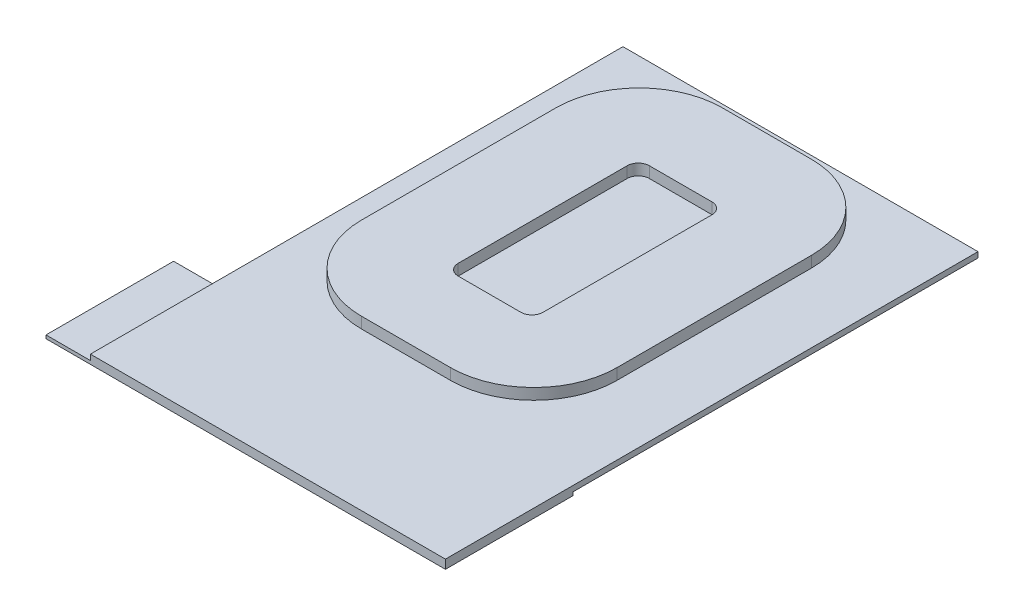
ISO-10303-21;
HEADER;
FILE_DESCRIPTION(('STEP AP214'),'2;1');
FILE_NAME('part.step','',(''),(''),'','','');
FILE_SCHEMA(('AUTOMOTIVE_DESIGN { 1 0 10303 214 1 1 1 1 }'));
ENDSEC;
DATA;
#1=APPLICATION_CONTEXT('core data for automotive mechanical design processes');
#2=APPLICATION_PROTOCOL_DEFINITION('international standard','automotive_design',2000,#1);
#3=PRODUCT_CONTEXT('',#1,'mechanical');
#4=PRODUCT('Part','Part','',(#3));
#5=PRODUCT_RELATED_PRODUCT_CATEGORY('part','',(#4));
#6=PRODUCT_DEFINITION_FORMATION('','',#4);
#7=PRODUCT_DEFINITION_CONTEXT('part definition',#1,'design');
#8=PRODUCT_DEFINITION('design','',#6,#7);
#9=PRODUCT_DEFINITION_SHAPE('','',#8);
#10=(LENGTH_UNIT() NAMED_UNIT(*) SI_UNIT(.MILLI.,.METRE.));
#11=(NAMED_UNIT(*) PLANE_ANGLE_UNIT() SI_UNIT($,.RADIAN.));
#12=(NAMED_UNIT(*) SI_UNIT($,.STERADIAN.) SOLID_ANGLE_UNIT());
#13=UNCERTAINTY_MEASURE_WITH_UNIT(LENGTH_MEASURE(1.E-05),#10,'distance_accuracy_value','');
#14=(GEOMETRIC_REPRESENTATION_CONTEXT(3) GLOBAL_UNCERTAINTY_ASSIGNED_CONTEXT((#13)) GLOBAL_UNIT_ASSIGNED_CONTEXT((#10,
#11,#12)) REPRESENTATION_CONTEXT('',''));
#15=CARTESIAN_POINT('',(0.,0.,0.));
#16=DIRECTION('',(0.,0.,1.));
#17=DIRECTION('',(1.,0.,0.));
#18=AXIS2_PLACEMENT_3D('',#15,#16,#17);
#19=CARTESIAN_POINT('',(0.,0.5,0.));
#20=DIRECTION('',(0.,-1.,0.));
#21=DIRECTION('',(0.,0.,-1.));
#22=AXIS2_PLACEMENT_3D('',#19,#20,#21);
#23=PLANE('',#22);
#24=DIRECTION('',(0.,0.,-1.));
#25=VECTOR('',#24,1.);
#26=CARTESIAN_POINT('',(16.,0.5,24.));
#27=LINE('',#26,#25);
#28=CARTESIAN_POINT('',(16.,0.5,24.));
#29=VERTEX_POINT('',#28);
#30=CARTESIAN_POINT('',(16.,0.5,-24.));
#31=VERTEX_POINT('',#30);
#32=EDGE_CURVE('E201',#29,#31,#27,.T.);
#33=ORIENTED_EDGE('',*,*,#32,.T.);
#34=DIRECTION('',(-1.,0.,0.));
#35=VECTOR('',#34,1.);
#36=CARTESIAN_POINT('',(-16.,0.5,-24.));
#37=LINE('',#36,#35);
#38=CARTESIAN_POINT('',(-16.,0.5,-24.));
#39=VERTEX_POINT('',#38);
#40=EDGE_CURVE('E359',#31,#39,#37,.T.);
#41=ORIENTED_EDGE('',*,*,#40,.T.);
#42=DIRECTION('',(0.,0.,1.));
#43=VECTOR('',#42,1.);
#44=CARTESIAN_POINT('',(-16.,0.5,24.));
#45=LINE('',#44,#43);
#46=CARTESIAN_POINT('',(-16.,0.5,24.));
#47=VERTEX_POINT('',#46);
#48=EDGE_CURVE('E362',#39,#47,#45,.T.);
#49=ORIENTED_EDGE('',*,*,#48,.T.);
#50=DIRECTION('',(1.,0.,0.));
#51=VECTOR('',#50,1.);
#52=CARTESIAN_POINT('',(-16.,0.5,24.));
#53=LINE('',#52,#51);
#54=EDGE_CURVE('E205',#47,#29,#53,.T.);
#55=ORIENTED_EDGE('',*,*,#54,.T.);
#56=EDGE_LOOP('',(#33,#41,#49,#55));
#57=FACE_BOUND('',#56,.T.);
#58=CARTESIAN_POINT('',(-5.7444345917951,0.5,2.32262018358056));
#59=DIRECTION('',(0.,1.,0.));
#60=DIRECTION('',(0.,0.,1.));
#61=AXIS2_PLACEMENT_3D('',#58,#59,#60);
#62=CIRCLE('',#61,7.5);
#63=CARTESIAN_POINT('',(-13.2444345917951,0.5,2.32262018358051));
#64=VERTEX_POINT('',#63);
#65=CARTESIAN_POINT('',(-5.74443459179504,0.5,9.82262018358056));
#66=VERTEX_POINT('',#65);
#67=EDGE_CURVE('E295',#64,#66,#62,.T.);
#68=ORIENTED_EDGE('',*,*,#67,.F.);
#69=DIRECTION('',(0.,0.,1.));
#70=VECTOR('',#69,1.);
#71=CARTESIAN_POINT('',(-13.2444345917951,0.5,-15.2047450145058));
#72=LINE('',#71,#70);
#73=CARTESIAN_POINT('',(-13.2444345917951,0.5,-15.2047450145058));
#74=VERTEX_POINT('',#73);
#75=EDGE_CURVE('E300',#74,#64,#72,.T.);
#76=ORIENTED_EDGE('',*,*,#75,.F.);
#77=CARTESIAN_POINT('',(-5.7444345917951,0.5,-15.2047450145059));
#78=DIRECTION('',(0.,1.,0.));
#79=DIRECTION('',(0.,0.,1.));
#80=AXIS2_PLACEMENT_3D('',#77,#78,#79);
#81=CIRCLE('',#80,7.5);
#82=CARTESIAN_POINT('',(-5.7444345917951,0.5,-22.7047450145059));
#83=VERTEX_POINT('',#82);
#84=EDGE_CURVE('E330',#83,#74,#81,.T.);
#85=ORIENTED_EDGE('',*,*,#84,.F.);
#86=DIRECTION('',(-1.,0.,0.));
#87=VECTOR('',#86,1.);
#88=CARTESIAN_POINT('',(-5.74443459179505,0.5,-22.7047450145059));
#89=LINE('',#88,#87);
#90=CARTESIAN_POINT('',(2.28236354348386,0.5,-22.7047450145059));
#91=VERTEX_POINT('',#90);
#92=EDGE_CURVE('E327',#91,#83,#89,.T.);
#93=ORIENTED_EDGE('',*,*,#92,.F.);
#94=CARTESIAN_POINT('',(2.28236354348391,0.5,-15.2047450145059));
#95=DIRECTION('',(0.,1.,0.));
#96=DIRECTION('',(0.,0.,-1.));
#97=AXIS2_PLACEMENT_3D('',#94,#95,#96);
#98=CIRCLE('',#97,7.5);
#99=CARTESIAN_POINT('',(9.78236354348391,0.5,-15.2047450145058));
#100=VERTEX_POINT('',#99);
#101=EDGE_CURVE('E324',#100,#91,#98,.T.);
#102=ORIENTED_EDGE('',*,*,#101,.F.);
#103=DIRECTION('',(0.,0.,-1.));
#104=VECTOR('',#103,1.);
#105=CARTESIAN_POINT('',(9.78236354348391,0.5,-15.2047450145058));
#106=LINE('',#105,#104);
#107=CARTESIAN_POINT('',(9.78236354348391,0.5,2.32262018358051));
#108=VERTEX_POINT('',#107);
#109=EDGE_CURVE('E321',#108,#100,#106,.T.);
#110=ORIENTED_EDGE('',*,*,#109,.F.);
#111=CARTESIAN_POINT('',(2.28236354348391,0.5,2.32262018358056));
#112=DIRECTION('',(0.,1.,0.));
#113=DIRECTION('',(0.,0.,1.));
#114=AXIS2_PLACEMENT_3D('',#111,#112,#113);
#115=CIRCLE('',#114,7.5);
#116=CARTESIAN_POINT('',(2.28236354348386,0.5,9.82262018358056));
#117=VERTEX_POINT('',#116);
#118=EDGE_CURVE('E318',#117,#108,#115,.T.);
#119=ORIENTED_EDGE('',*,*,#118,.F.);
#120=DIRECTION('',(1.,0.,0.));
#121=VECTOR('',#120,1.);
#122=CARTESIAN_POINT('',(-5.74443459179504,0.5,9.82262018358056));
#123=LINE('',#122,#121);
#124=EDGE_CURVE('E57',#66,#117,#123,.T.);
#125=ORIENTED_EDGE('',*,*,#124,.F.);
#126=EDGE_LOOP('',(#68,#76,#85,#93,#102,#110,#119,#125));
#127=FACE_BOUND('',#126,.T.);
#128=ADVANCED_FACE('F34',(#57,#127),#23,.F.);
#129=CARTESIAN_POINT('',(16.,0.5,24.));
#130=DIRECTION('',(-1.,0.,0.));
#131=DIRECTION('',(0.,0.,1.));
#132=AXIS2_PLACEMENT_3D('',#129,#130,#131);
#133=PLANE('',#132);
#134=DIRECTION('',(0.,-1.,0.));
#135=VECTOR('',#134,1.);
#136=CARTESIAN_POINT('',(16.,0.5,24.));
#137=LINE('',#136,#135);
#138=CARTESIAN_POINT('',(16.,-0.3,24.));
#139=VERTEX_POINT('',#138);
#140=EDGE_CURVE('E194',#29,#139,#137,.T.);
#141=ORIENTED_EDGE('',*,*,#140,.T.);
#142=DIRECTION('',(0.,0.,1.));
#143=VECTOR('',#142,1.);
#144=CARTESIAN_POINT('',(16.,-0.3,24.));
#145=LINE('',#144,#143);
#146=CARTESIAN_POINT('',(16.,-0.3,12.5));
#147=VERTEX_POINT('',#146);
#148=EDGE_CURVE('E198',#147,#139,#145,.T.);
#149=ORIENTED_EDGE('',*,*,#148,.F.);
#150=DIRECTION('',(0.,1.,0.));
#151=VECTOR('',#150,1.);
#152=CARTESIAN_POINT('',(16.,-0.3,12.5));
#153=LINE('',#152,#151);
#154=CARTESIAN_POINT('',(16.,0.,12.5));
#155=VERTEX_POINT('',#154);
#156=EDGE_CURVE('E229',#147,#155,#153,.T.);
#157=ORIENTED_EDGE('',*,*,#156,.T.);
#158=DIRECTION('',(0.,0.,-1.));
#159=VECTOR('',#158,1.);
#160=CARTESIAN_POINT('',(16.,0.,24.));
#161=LINE('',#160,#159);
#162=CARTESIAN_POINT('',(16.,0.,-24.));
#163=VERTEX_POINT('',#162);
#164=EDGE_CURVE('E357',#155,#163,#161,.T.);
#165=ORIENTED_EDGE('',*,*,#164,.T.);
#166=DIRECTION('',(0.,-1.,0.));
#167=VECTOR('',#166,1.);
#168=CARTESIAN_POINT('',(16.,0.5,-24.));
#169=LINE('',#168,#167);
#170=EDGE_CURVE('E43',#31,#163,#169,.T.);
#171=ORIENTED_EDGE('',*,*,#170,.F.);
#172=ORIENTED_EDGE('',*,*,#32,.F.);
#173=EDGE_LOOP('',(#141,#149,#157,#165,#171,#172));
#174=FACE_BOUND('',#173,.T.);
#175=ADVANCED_FACE('F36',(#174),#133,.F.);
#176=CARTESIAN_POINT('',(-16.,0.5,-24.));
#177=DIRECTION('',(0.,0.,1.));
#178=DIRECTION('',(1.,0.,0.));
#179=AXIS2_PLACEMENT_3D('',#176,#177,#178);
#180=PLANE('',#179);
#181=DIRECTION('',(-1.,0.,0.));
#182=VECTOR('',#181,1.);
#183=CARTESIAN_POINT('',(-16.,0.,-24.));
#184=LINE('',#183,#182);
#185=CARTESIAN_POINT('',(-16.,0.,-24.));
#186=VERTEX_POINT('',#185);
#187=EDGE_CURVE('E367',#163,#186,#184,.T.);
#188=ORIENTED_EDGE('',*,*,#187,.T.);
#189=DIRECTION('',(0.,-1.,0.));
#190=VECTOR('',#189,1.);
#191=CARTESIAN_POINT('',(-16.,0.5,-24.));
#192=LINE('',#191,#190);
#193=EDGE_CURVE('E393',#39,#186,#192,.T.);
#194=ORIENTED_EDGE('',*,*,#193,.F.);
#195=ORIENTED_EDGE('',*,*,#40,.F.);
#196=ORIENTED_EDGE('',*,*,#170,.T.);
#197=EDGE_LOOP('',(#188,#194,#195,#196));
#198=FACE_BOUND('',#197,.T.);
#199=ADVANCED_FACE('F401',(#198),#180,.F.);
#200=CARTESIAN_POINT('',(-16.,0.5,24.));
#201=DIRECTION('',(1.,0.,0.));
#202=DIRECTION('',(0.,0.,-1.));
#203=AXIS2_PLACEMENT_3D('',#200,#201,#202);
#204=PLANE('',#203);
#205=DIRECTION('',(0.,0.,1.));
#206=VECTOR('',#205,1.);
#207=CARTESIAN_POINT('',(-16.,0.,24.));
#208=LINE('',#207,#206);
#209=CARTESIAN_POINT('',(-16.,0.,12.5));
#210=VERTEX_POINT('',#209);
#211=EDGE_CURVE('E360',#186,#210,#208,.T.);
#212=ORIENTED_EDGE('',*,*,#211,.T.);
#213=CARTESIAN_POINT('',(-16.,0.,24.));
#214=VERTEX_POINT('',#213);
#215=EDGE_CURVE('E387',#210,#214,#208,.T.);
#216=ORIENTED_EDGE('',*,*,#215,.T.);
#217=DIRECTION('',(0.,-1.,0.));
#218=VECTOR('',#217,1.);
#219=CARTESIAN_POINT('',(-16.,0.5,24.));
#220=LINE('',#219,#218);
#221=EDGE_CURVE('E204',#47,#214,#220,.T.);
#222=ORIENTED_EDGE('',*,*,#221,.F.);
#223=ORIENTED_EDGE('',*,*,#48,.F.);
#224=ORIENTED_EDGE('',*,*,#193,.T.);
#225=EDGE_LOOP('',(#212,#216,#222,#223,#224));
#226=FACE_BOUND('',#225,.T.);
#227=ADVANCED_FACE('F398',(#226),#204,.F.);
#228=CARTESIAN_POINT('',(-16.,0.5,24.));
#229=DIRECTION('',(0.,0.,-1.));
#230=DIRECTION('',(-1.,0.,0.));
#231=AXIS2_PLACEMENT_3D('',#228,#229,#230);
#232=PLANE('',#231);
#233=ORIENTED_EDGE('',*,*,#221,.T.);
#234=DIRECTION('',(-1.,0.,0.));
#235=VECTOR('',#234,1.);
#236=CARTESIAN_POINT('',(16.,0.,24.));
#237=LINE('',#236,#235);
#238=CARTESIAN_POINT('',(-20.,0.,24.));
#239=VERTEX_POINT('',#238);
#240=EDGE_CURVE('E233',#214,#239,#237,.T.);
#241=ORIENTED_EDGE('',*,*,#240,.T.);
#242=DIRECTION('',(0.,1.,0.));
#243=VECTOR('',#242,1.);
#244=CARTESIAN_POINT('',(-20.,-0.3,24.));
#245=LINE('',#244,#243);
#246=CARTESIAN_POINT('',(-20.,-0.3,24.));
#247=VERTEX_POINT('',#246);
#248=EDGE_CURVE('E212',#247,#239,#245,.T.);
#249=ORIENTED_EDGE('',*,*,#248,.F.);
#250=DIRECTION('',(-1.,0.,0.));
#251=VECTOR('',#250,1.);
#252=CARTESIAN_POINT('',(16.,-0.3,24.));
#253=LINE('',#252,#251);
#254=EDGE_CURVE('E208',#139,#247,#253,.T.);
#255=ORIENTED_EDGE('',*,*,#254,.F.);
#256=ORIENTED_EDGE('',*,*,#140,.F.);
#257=ORIENTED_EDGE('',*,*,#54,.F.);
#258=EDGE_LOOP('',(#233,#241,#249,#255,#256,#257));
#259=FACE_BOUND('',#258,.T.);
#260=ADVANCED_FACE('F210',(#259),#232,.F.);
#261=CARTESIAN_POINT('',(0.,0.,0.));
#262=DIRECTION('',(0.,-1.,0.));
#263=DIRECTION('',(0.,0.,-1.));
#264=AXIS2_PLACEMENT_3D('',#261,#262,#263);
#265=PLANE('',#264);
#266=DIRECTION('',(1.,0.,0.));
#267=VECTOR('',#266,1.);
#268=CARTESIAN_POINT('',(16.,0.,12.5));
#269=LINE('',#268,#267);
#270=EDGE_CURVE('E11',#210,#155,#269,.T.);
#271=ORIENTED_EDGE('',*,*,#270,.F.);
#272=ORIENTED_EDGE('',*,*,#211,.F.);
#273=ORIENTED_EDGE('',*,*,#187,.F.);
#274=ORIENTED_EDGE('',*,*,#164,.F.);
#275=EDGE_LOOP('',(#271,#272,#273,#274));
#276=FACE_BOUND('',#275,.T.);
#277=ADVANCED_FACE('F402',(#276),#265,.T.);
#278=CARTESIAN_POINT('',(-5.7444345917951,1.5,2.32262018358056));
#279=DIRECTION('',(0.,1.,0.));
#280=DIRECTION('',(0.,0.,1.));
#281=AXIS2_PLACEMENT_3D('',#278,#279,#280);
#282=PLANE('',#281);
#283=CARTESIAN_POINT('',(-5.7444345917951,1.5,2.32262018358056));
#284=DIRECTION('',(0.,1.,0.));
#285=DIRECTION('',(0.,0.,1.));
#286=AXIS2_PLACEMENT_3D('',#283,#284,#285);
#287=CIRCLE('',#286,7.5);
#288=CARTESIAN_POINT('',(-13.2444345917951,1.5,2.32262018358051));
#289=VERTEX_POINT('',#288);
#290=CARTESIAN_POINT('',(-5.74443459179504,1.5,9.82262018358056));
#291=VERTEX_POINT('',#290);
#292=EDGE_CURVE('E296',#289,#291,#287,.T.);
#293=ORIENTED_EDGE('',*,*,#292,.T.);
#294=DIRECTION('',(1.,0.,0.));
#295=VECTOR('',#294,1.);
#296=CARTESIAN_POINT('',(-5.74443459179504,1.5,9.82262018358056));
#297=LINE('',#296,#295);
#298=CARTESIAN_POINT('',(2.28236354348386,1.5,9.82262018358056));
#299=VERTEX_POINT('',#298);
#300=EDGE_CURVE('E299',#291,#299,#297,.T.);
#301=ORIENTED_EDGE('',*,*,#300,.T.);
#302=CARTESIAN_POINT('',(2.28236354348391,1.5,2.32262018358056));
#303=DIRECTION('',(0.,1.,0.));
#304=DIRECTION('',(0.,0.,1.));
#305=AXIS2_PLACEMENT_3D('',#302,#303,#304);
#306=CIRCLE('',#305,7.5);
#307=CARTESIAN_POINT('',(9.78236354348391,1.5,2.32262018358051));
#308=VERTEX_POINT('',#307);
#309=EDGE_CURVE('E302',#299,#308,#306,.T.);
#310=ORIENTED_EDGE('',*,*,#309,.T.);
#311=DIRECTION('',(0.,0.,-1.));
#312=VECTOR('',#311,1.);
#313=CARTESIAN_POINT('',(9.78236354348391,1.5,-15.2047450145058));
#314=LINE('',#313,#312);
#315=CARTESIAN_POINT('',(9.78236354348391,1.5,-15.2047450145058));
#316=VERTEX_POINT('',#315);
#317=EDGE_CURVE('E304',#308,#316,#314,.T.);
#318=ORIENTED_EDGE('',*,*,#317,.T.);
#319=CARTESIAN_POINT('',(2.28236354348391,1.5,-15.2047450145059));
#320=DIRECTION('',(0.,1.,0.));
#321=DIRECTION('',(0.,0.,-1.));
#322=AXIS2_PLACEMENT_3D('',#319,#320,#321);
#323=CIRCLE('',#322,7.5);
#324=CARTESIAN_POINT('',(2.28236354348386,1.5,-22.7047450145059));
#325=VERTEX_POINT('',#324);
#326=EDGE_CURVE('E306',#316,#325,#323,.T.);
#327=ORIENTED_EDGE('',*,*,#326,.T.);
#328=DIRECTION('',(-1.,0.,0.));
#329=VECTOR('',#328,1.);
#330=CARTESIAN_POINT('',(-5.74443459179505,1.5,-22.7047450145059));
#331=LINE('',#330,#329);
#332=CARTESIAN_POINT('',(-5.74443459179505,1.5,-22.7047450145059));
#333=VERTEX_POINT('',#332);
#334=EDGE_CURVE('E308',#325,#333,#331,.T.);
#335=ORIENTED_EDGE('',*,*,#334,.T.);
#336=CARTESIAN_POINT('',(-5.7444345917951,1.5,-15.2047450145059));
#337=DIRECTION('',(0.,1.,0.));
#338=DIRECTION('',(0.,0.,1.));
#339=AXIS2_PLACEMENT_3D('',#336,#337,#338);
#340=CIRCLE('',#339,7.5);
#341=CARTESIAN_POINT('',(-13.2444345917951,1.5,-15.2047450145058));
#342=VERTEX_POINT('',#341);
#343=EDGE_CURVE('E310',#333,#342,#340,.T.);
#344=ORIENTED_EDGE('',*,*,#343,.T.);
#345=DIRECTION('',(0.,0.,1.));
#346=VECTOR('',#345,1.);
#347=CARTESIAN_POINT('',(-13.2444345917951,1.5,-15.2047450145058));
#348=LINE('',#347,#346);
#349=EDGE_CURVE('E312',#342,#289,#348,.T.);
#350=ORIENTED_EDGE('',*,*,#349,.T.);
#351=EDGE_LOOP('',(#293,#301,#310,#318,#327,#335,#344,#350));
#352=FACE_BOUND('',#351,.T.);
#353=DIRECTION('',(0.,0.,1.));
#354=VECTOR('',#353,1.);
#355=CARTESIAN_POINT('',(-5.5151596932399,1.5,-13.8949568357574));
#356=LINE('',#355,#354);
#357=CARTESIAN_POINT('',(-5.5151596932399,1.5,-13.8949568357574));
#358=VERTEX_POINT('',#357);
#359=CARTESIAN_POINT('',(-5.5151596932399,1.5,1.33488512560521));
#360=VERTEX_POINT('',#359);
#361=EDGE_CURVE('E239',#358,#360,#356,.T.);
#362=ORIENTED_EDGE('',*,*,#361,.F.);
#363=CARTESIAN_POINT('',(-4.5151596932399,1.5,-13.8949568357574));
#364=DIRECTION('',(0.,1.,0.));
#365=DIRECTION('',(0.,0.,1.));
#366=AXIS2_PLACEMENT_3D('',#363,#364,#365);
#367=CIRCLE('',#366,1.);
#368=CARTESIAN_POINT('',(-4.51515969323989,1.5,-14.8949568357574));
#369=VERTEX_POINT('',#368);
#370=EDGE_CURVE('E237',#369,#358,#367,.T.);
#371=ORIENTED_EDGE('',*,*,#370,.F.);
#372=DIRECTION('',(-1.,0.,0.));
#373=VECTOR('',#372,1.);
#374=CARTESIAN_POINT('',(-4.51515969323989,1.5,-14.8949568357574));
#375=LINE('',#374,#373);
#376=CARTESIAN_POINT('',(1.133601925122,1.5,-14.8949568357574));
#377=VERTEX_POINT('',#376);
#378=EDGE_CURVE('E253',#377,#369,#375,.T.);
#379=ORIENTED_EDGE('',*,*,#378,.F.);
#380=CARTESIAN_POINT('',(1.13360192512201,1.5,-13.8949568357574));
#381=DIRECTION('',(0.,1.,0.));
#382=DIRECTION('',(0.,0.,-1.));
#383=AXIS2_PLACEMENT_3D('',#380,#381,#382);
#384=CIRCLE('',#383,1.);
#385=CARTESIAN_POINT('',(2.13360192512201,1.5,-13.8949568357574));
#386=VERTEX_POINT('',#385);
#387=EDGE_CURVE('E250',#386,#377,#384,.T.);
#388=ORIENTED_EDGE('',*,*,#387,.F.);
#389=DIRECTION('',(0.,0.,-1.));
#390=VECTOR('',#389,1.);
#391=CARTESIAN_POINT('',(2.13360192512201,1.5,-13.8949568357574));
#392=LINE('',#391,#390);
#393=CARTESIAN_POINT('',(2.13360192512201,1.5,1.33488512560521));
#394=VERTEX_POINT('',#393);
#395=EDGE_CURVE('E248',#394,#386,#392,.T.);
#396=ORIENTED_EDGE('',*,*,#395,.F.);
#397=CARTESIAN_POINT('',(1.13360192512201,1.5,1.33488512560521));
#398=DIRECTION('',(0.,1.,0.));
#399=DIRECTION('',(0.,0.,1.));
#400=AXIS2_PLACEMENT_3D('',#397,#398,#399);
#401=CIRCLE('',#400,1.);
#402=CARTESIAN_POINT('',(1.133601925122,1.5,2.33488512560521));
#403=VERTEX_POINT('',#402);
#404=EDGE_CURVE('E246',#403,#394,#401,.T.);
#405=ORIENTED_EDGE('',*,*,#404,.F.);
#406=DIRECTION('',(1.,0.,0.));
#407=VECTOR('',#406,1.);
#408=CARTESIAN_POINT('',(-4.51515969323989,1.5,2.33488512560521));
#409=LINE('',#408,#407);
#410=CARTESIAN_POINT('',(-4.51515969323989,1.5,2.33488512560521));
#411=VERTEX_POINT('',#410);
#412=EDGE_CURVE('E244',#411,#403,#409,.T.);
#413=ORIENTED_EDGE('',*,*,#412,.F.);
#414=CARTESIAN_POINT('',(-4.5151596932399,1.5,1.33488512560521));
#415=DIRECTION('',(0.,1.,0.));
#416=DIRECTION('',(0.,0.,1.));
#417=AXIS2_PLACEMENT_3D('',#414,#415,#416);
#418=CIRCLE('',#417,1.);
#419=EDGE_CURVE('E242',#360,#411,#418,.T.);
#420=ORIENTED_EDGE('',*,*,#419,.F.);
#421=EDGE_LOOP('',(#362,#371,#379,#388,#396,#405,#413,#420));
#422=FACE_BOUND('',#421,.T.);
#423=ADVANCED_FACE('F404',(#352,#422),#282,.T.);
#424=CARTESIAN_POINT('',(-5.7444345917951,1.5,2.32262018358056));
#425=DIRECTION('',(0.,-1.,0.));
#426=DIRECTION('',(0.,0.,-1.));
#427=AXIS2_PLACEMENT_3D('',#424,#425,#426);
#428=CYLINDRICAL_SURFACE('',#427,7.5);
#429=ORIENTED_EDGE('',*,*,#67,.T.);
#430=DIRECTION('',(0.,-1.,0.));
#431=VECTOR('',#430,1.);
#432=CARTESIAN_POINT('',(-5.74443459179504,1.5,9.82262018358056));
#433=LINE('',#432,#431);
#434=EDGE_CURVE('E355',#291,#66,#433,.T.);
#435=ORIENTED_EDGE('',*,*,#434,.F.);
#436=ORIENTED_EDGE('',*,*,#292,.F.);
#437=DIRECTION('',(0.,-1.,0.));
#438=VECTOR('',#437,1.);
#439=CARTESIAN_POINT('',(-13.2444345917951,1.5,2.32262018358051));
#440=LINE('',#439,#438);
#441=EDGE_CURVE('E314',#289,#64,#440,.T.);
#442=ORIENTED_EDGE('',*,*,#441,.T.);
#443=EDGE_LOOP('',(#429,#435,#436,#442));
#444=FACE_BOUND('',#443,.T.);
#445=ADVANCED_FACE('F410',(#444),#428,.T.);
#446=CARTESIAN_POINT('',(-5.74443459179504,1.5,9.82262018358056));
#447=DIRECTION('',(0.,0.,-1.));
#448=DIRECTION('',(-1.,0.,0.));
#449=AXIS2_PLACEMENT_3D('',#446,#447,#448);
#450=PLANE('',#449);
#451=ORIENTED_EDGE('',*,*,#124,.T.);
#452=DIRECTION('',(0.,-1.,0.));
#453=VECTOR('',#452,1.);
#454=CARTESIAN_POINT('',(2.28236354348386,1.5,9.82262018358056));
#455=LINE('',#454,#453);
#456=EDGE_CURVE('E352',#299,#117,#455,.T.);
#457=ORIENTED_EDGE('',*,*,#456,.F.);
#458=ORIENTED_EDGE('',*,*,#300,.F.);
#459=ORIENTED_EDGE('',*,*,#434,.T.);
#460=EDGE_LOOP('',(#451,#457,#458,#459));
#461=FACE_BOUND('',#460,.T.);
#462=ADVANCED_FACE('F510',(#461),#450,.F.);
#463=CARTESIAN_POINT('',(2.28236354348391,1.5,2.32262018358056));
#464=DIRECTION('',(0.,-1.,0.));
#465=DIRECTION('',(0.,0.,-1.));
#466=AXIS2_PLACEMENT_3D('',#463,#464,#465);
#467=CYLINDRICAL_SURFACE('',#466,7.5);
#468=ORIENTED_EDGE('',*,*,#118,.T.);
#469=DIRECTION('',(0.,-1.,0.));
#470=VECTOR('',#469,1.);
#471=CARTESIAN_POINT('',(9.78236354348391,1.5,2.32262018358051));
#472=LINE('',#471,#470);
#473=EDGE_CURVE('E349',#308,#108,#472,.T.);
#474=ORIENTED_EDGE('',*,*,#473,.F.);
#475=ORIENTED_EDGE('',*,*,#309,.F.);
#476=ORIENTED_EDGE('',*,*,#456,.T.);
#477=EDGE_LOOP('',(#468,#474,#475,#476));
#478=FACE_BOUND('',#477,.T.);
#479=ADVANCED_FACE('F506',(#478),#467,.T.);
#480=CARTESIAN_POINT('',(9.78236354348391,1.5,-15.2047450145058));
#481=DIRECTION('',(-1.,0.,0.));
#482=DIRECTION('',(0.,0.,1.));
#483=AXIS2_PLACEMENT_3D('',#480,#481,#482);
#484=PLANE('',#483);
#485=ORIENTED_EDGE('',*,*,#109,.T.);
#486=DIRECTION('',(0.,-1.,0.));
#487=VECTOR('',#486,1.);
#488=CARTESIAN_POINT('',(9.78236354348391,1.5,-15.2047450145058));
#489=LINE('',#488,#487);
#490=EDGE_CURVE('E346',#316,#100,#489,.T.);
#491=ORIENTED_EDGE('',*,*,#490,.F.);
#492=ORIENTED_EDGE('',*,*,#317,.F.);
#493=ORIENTED_EDGE('',*,*,#473,.T.);
#494=EDGE_LOOP('',(#485,#491,#492,#493));
#495=FACE_BOUND('',#494,.T.);
#496=ADVANCED_FACE('F502',(#495),#484,.F.);
#497=CARTESIAN_POINT('',(2.28236354348391,1.5,-15.2047450145059));
#498=DIRECTION('',(0.,-1.,0.));
#499=DIRECTION('',(0.,0.,-1.));
#500=AXIS2_PLACEMENT_3D('',#497,#498,#499);
#501=CYLINDRICAL_SURFACE('',#500,7.5);
#502=ORIENTED_EDGE('',*,*,#101,.T.);
#503=DIRECTION('',(0.,-1.,0.));
#504=VECTOR('',#503,1.);
#505=CARTESIAN_POINT('',(2.28236354348386,1.5,-22.7047450145059));
#506=LINE('',#505,#504);
#507=EDGE_CURVE('E343',#325,#91,#506,.T.);
#508=ORIENTED_EDGE('',*,*,#507,.F.);
#509=ORIENTED_EDGE('',*,*,#326,.F.);
#510=ORIENTED_EDGE('',*,*,#490,.T.);
#511=EDGE_LOOP('',(#502,#508,#509,#510));
#512=FACE_BOUND('',#511,.T.);
#513=ADVANCED_FACE('F498',(#512),#501,.T.);
#514=CARTESIAN_POINT('',(-5.74443459179505,1.5,-22.7047450145059));
#515=DIRECTION('',(0.,0.,1.));
#516=DIRECTION('',(1.,0.,0.));
#517=AXIS2_PLACEMENT_3D('',#514,#515,#516);
#518=PLANE('',#517);
#519=ORIENTED_EDGE('',*,*,#92,.T.);
#520=DIRECTION('',(0.,-1.,0.));
#521=VECTOR('',#520,1.);
#522=CARTESIAN_POINT('',(-5.74443459179505,1.5,-22.7047450145059));
#523=LINE('',#522,#521);
#524=EDGE_CURVE('E340',#333,#83,#523,.T.);
#525=ORIENTED_EDGE('',*,*,#524,.F.);
#526=ORIENTED_EDGE('',*,*,#334,.F.);
#527=ORIENTED_EDGE('',*,*,#507,.T.);
#528=EDGE_LOOP('',(#519,#525,#526,#527));
#529=FACE_BOUND('',#528,.T.);
#530=ADVANCED_FACE('F494',(#529),#518,.F.);
#531=CARTESIAN_POINT('',(-5.7444345917951,1.5,-15.2047450145059));
#532=DIRECTION('',(0.,-1.,0.));
#533=DIRECTION('',(0.,0.,-1.));
#534=AXIS2_PLACEMENT_3D('',#531,#532,#533);
#535=CYLINDRICAL_SURFACE('',#534,7.5);
#536=ORIENTED_EDGE('',*,*,#84,.T.);
#537=DIRECTION('',(0.,-1.,0.));
#538=VECTOR('',#537,1.);
#539=CARTESIAN_POINT('',(-13.2444345917951,1.5,-15.2047450145058));
#540=LINE('',#539,#538);
#541=EDGE_CURVE('E337',#342,#74,#540,.T.);
#542=ORIENTED_EDGE('',*,*,#541,.F.);
#543=ORIENTED_EDGE('',*,*,#343,.F.);
#544=ORIENTED_EDGE('',*,*,#524,.T.);
#545=EDGE_LOOP('',(#536,#542,#543,#544));
#546=FACE_BOUND('',#545,.T.);
#547=ADVANCED_FACE('F490',(#546),#535,.T.);
#548=CARTESIAN_POINT('',(-13.2444345917951,1.5,-15.2047450145058));
#549=DIRECTION('',(1.,0.,0.));
#550=DIRECTION('',(0.,0.,-1.));
#551=AXIS2_PLACEMENT_3D('',#548,#549,#550);
#552=PLANE('',#551);
#553=ORIENTED_EDGE('',*,*,#75,.T.);
#554=ORIENTED_EDGE('',*,*,#441,.F.);
#555=ORIENTED_EDGE('',*,*,#349,.F.);
#556=ORIENTED_EDGE('',*,*,#541,.T.);
#557=EDGE_LOOP('',(#553,#554,#555,#556));
#558=FACE_BOUND('',#557,.T.);
#559=ADVANCED_FACE('F486',(#558),#552,.F.);
#560=CARTESIAN_POINT('',(-4.5151596932399,1.5,-13.8949568357574));
#561=DIRECTION('',(0.,-1.,0.));
#562=DIRECTION('',(0.,0.,-1.));
#563=AXIS2_PLACEMENT_3D('',#560,#561,#562);
#564=CYLINDRICAL_SURFACE('',#563,1.);
#565=CARTESIAN_POINT('',(-4.5151596932399,0.5,-13.8949568357574));
#566=DIRECTION('',(0.,1.,0.));
#567=DIRECTION('',(0.,0.,1.));
#568=AXIS2_PLACEMENT_3D('',#565,#566,#567);
#569=CIRCLE('',#568,1.);
#570=CARTESIAN_POINT('',(-4.51515969323989,0.5,-14.8949568357574));
#571=VERTEX_POINT('',#570);
#572=CARTESIAN_POINT('',(-5.5151596932399,0.5,-13.8949568357574));
#573=VERTEX_POINT('',#572);
#574=EDGE_CURVE('E256',#571,#573,#569,.T.);
#575=ORIENTED_EDGE('',*,*,#574,.F.);
#576=DIRECTION('',(0.,-1.,0.));
#577=VECTOR('',#576,1.);
#578=CARTESIAN_POINT('',(-4.51515969323989,1.5,-14.8949568357574));
#579=LINE('',#578,#577);
#580=EDGE_CURVE('E255',#369,#571,#579,.T.);
#581=ORIENTED_EDGE('',*,*,#580,.F.);
#582=ORIENTED_EDGE('',*,*,#370,.T.);
#583=DIRECTION('',(0.,-1.,0.));
#584=VECTOR('',#583,1.);
#585=CARTESIAN_POINT('',(-5.5151596932399,1.5,-13.8949568357574));
#586=LINE('',#585,#584);
#587=EDGE_CURVE('E292',#358,#573,#586,.T.);
#588=ORIENTED_EDGE('',*,*,#587,.T.);
#589=EDGE_LOOP('',(#575,#581,#582,#588));
#590=FACE_BOUND('',#589,.T.);
#591=ADVANCED_FACE('F440',(#590),#564,.F.);
#592=CARTESIAN_POINT('',(-5.5151596932399,1.5,-13.8949568357574));
#593=DIRECTION('',(1.,0.,0.));
#594=DIRECTION('',(0.,0.,-1.));
#595=AXIS2_PLACEMENT_3D('',#592,#593,#594);
#596=PLANE('',#595);
#597=DIRECTION('',(0.,0.,1.));
#598=VECTOR('',#597,1.);
#599=CARTESIAN_POINT('',(-5.5151596932399,0.5,-13.8949568357574));
#600=LINE('',#599,#598);
#601=CARTESIAN_POINT('',(-5.5151596932399,0.5,1.33488512560521));
#602=VERTEX_POINT('',#601);
#603=EDGE_CURVE('E259',#573,#602,#600,.T.);
#604=ORIENTED_EDGE('',*,*,#603,.F.);
#605=ORIENTED_EDGE('',*,*,#587,.F.);
#606=ORIENTED_EDGE('',*,*,#361,.T.);
#607=DIRECTION('',(0.,-1.,0.));
#608=VECTOR('',#607,1.);
#609=CARTESIAN_POINT('',(-5.5151596932399,1.5,1.33488512560521));
#610=LINE('',#609,#608);
#611=EDGE_CURVE('E290',#360,#602,#610,.T.);
#612=ORIENTED_EDGE('',*,*,#611,.T.);
#613=EDGE_LOOP('',(#604,#605,#606,#612));
#614=FACE_BOUND('',#613,.T.);
#615=ADVANCED_FACE('F444',(#614),#596,.T.);
#616=CARTESIAN_POINT('',(-4.5151596932399,1.5,1.33488512560521));
#617=DIRECTION('',(0.,-1.,0.));
#618=DIRECTION('',(0.,0.,-1.));
#619=AXIS2_PLACEMENT_3D('',#616,#617,#618);
#620=CYLINDRICAL_SURFACE('',#619,1.);
#621=CARTESIAN_POINT('',(-4.5151596932399,0.5,1.33488512560521));
#622=DIRECTION('',(0.,1.,0.));
#623=DIRECTION('',(0.,0.,1.));
#624=AXIS2_PLACEMENT_3D('',#621,#622,#623);
#625=CIRCLE('',#624,1.);
#626=CARTESIAN_POINT('',(-4.51515969323989,0.5,2.33488512560521));
#627=VERTEX_POINT('',#626);
#628=EDGE_CURVE('E262',#602,#627,#625,.T.);
#629=ORIENTED_EDGE('',*,*,#628,.F.);
#630=ORIENTED_EDGE('',*,*,#611,.F.);
#631=ORIENTED_EDGE('',*,*,#419,.T.);
#632=DIRECTION('',(0.,-1.,0.));
#633=VECTOR('',#632,1.);
#634=CARTESIAN_POINT('',(-4.51515969323989,1.5,2.33488512560521));
#635=LINE('',#634,#633);
#636=EDGE_CURVE('E288',#411,#627,#635,.T.);
#637=ORIENTED_EDGE('',*,*,#636,.T.);
#638=EDGE_LOOP('',(#629,#630,#631,#637));
#639=FACE_BOUND('',#638,.T.);
#640=ADVANCED_FACE('F453',(#639),#620,.F.);
#641=CARTESIAN_POINT('',(-4.51515969323989,1.5,2.33488512560521));
#642=DIRECTION('',(0.,0.,-1.));
#643=DIRECTION('',(-1.,0.,0.));
#644=AXIS2_PLACEMENT_3D('',#641,#642,#643);
#645=PLANE('',#644);
#646=DIRECTION('',(1.,0.,0.));
#647=VECTOR('',#646,1.);
#648=CARTESIAN_POINT('',(-4.51515969323989,0.5,2.33488512560521));
#649=LINE('',#648,#647);
#650=CARTESIAN_POINT('',(1.133601925122,0.5,2.33488512560521));
#651=VERTEX_POINT('',#650);
#652=EDGE_CURVE('E265',#627,#651,#649,.T.);
#653=ORIENTED_EDGE('',*,*,#652,.F.);
#654=ORIENTED_EDGE('',*,*,#636,.F.);
#655=ORIENTED_EDGE('',*,*,#412,.T.);
#656=DIRECTION('',(0.,-1.,0.));
#657=VECTOR('',#656,1.);
#658=CARTESIAN_POINT('',(1.133601925122,1.5,2.33488512560521));
#659=LINE('',#658,#657);
#660=EDGE_CURVE('E286',#403,#651,#659,.T.);
#661=ORIENTED_EDGE('',*,*,#660,.T.);
#662=EDGE_LOOP('',(#653,#654,#655,#661));
#663=FACE_BOUND('',#662,.T.);
#664=ADVANCED_FACE('F456',(#663),#645,.T.);
#665=CARTESIAN_POINT('',(1.13360192512201,1.5,1.33488512560521));
#666=DIRECTION('',(0.,-1.,0.));
#667=DIRECTION('',(0.,0.,-1.));
#668=AXIS2_PLACEMENT_3D('',#665,#666,#667);
#669=CYLINDRICAL_SURFACE('',#668,1.);
#670=CARTESIAN_POINT('',(1.13360192512201,0.5,1.33488512560521));
#671=DIRECTION('',(0.,1.,0.));
#672=DIRECTION('',(0.,0.,1.));
#673=AXIS2_PLACEMENT_3D('',#670,#671,#672);
#674=CIRCLE('',#673,1.);
#675=CARTESIAN_POINT('',(2.13360192512201,0.5,1.33488512560521));
#676=VERTEX_POINT('',#675);
#677=EDGE_CURVE('E268',#651,#676,#674,.T.);
#678=ORIENTED_EDGE('',*,*,#677,.F.);
#679=ORIENTED_EDGE('',*,*,#660,.F.);
#680=ORIENTED_EDGE('',*,*,#404,.T.);
#681=DIRECTION('',(0.,-1.,0.));
#682=VECTOR('',#681,1.);
#683=CARTESIAN_POINT('',(2.13360192512201,1.5,1.33488512560521));
#684=LINE('',#683,#682);
#685=EDGE_CURVE('E284',#394,#676,#684,.T.);
#686=ORIENTED_EDGE('',*,*,#685,.T.);
#687=EDGE_LOOP('',(#678,#679,#680,#686));
#688=FACE_BOUND('',#687,.T.);
#689=ADVANCED_FACE('F461',(#688),#669,.F.);
#690=CARTESIAN_POINT('',(2.13360192512201,1.5,-13.8949568357574));
#691=DIRECTION('',(-1.,0.,0.));
#692=DIRECTION('',(0.,0.,1.));
#693=AXIS2_PLACEMENT_3D('',#690,#691,#692);
#694=PLANE('',#693);
#695=DIRECTION('',(0.,0.,-1.));
#696=VECTOR('',#695,1.);
#697=CARTESIAN_POINT('',(2.13360192512201,0.5,-13.8949568357574));
#698=LINE('',#697,#696);
#699=CARTESIAN_POINT('',(2.13360192512201,0.5,-13.8949568357574));
#700=VERTEX_POINT('',#699);
#701=EDGE_CURVE('E271',#676,#700,#698,.T.);
#702=ORIENTED_EDGE('',*,*,#701,.F.);
#703=ORIENTED_EDGE('',*,*,#685,.F.);
#704=ORIENTED_EDGE('',*,*,#395,.T.);
#705=DIRECTION('',(0.,-1.,0.));
#706=VECTOR('',#705,1.);
#707=CARTESIAN_POINT('',(2.13360192512201,1.5,-13.8949568357574));
#708=LINE('',#707,#706);
#709=EDGE_CURVE('E282',#386,#700,#708,.T.);
#710=ORIENTED_EDGE('',*,*,#709,.T.);
#711=EDGE_LOOP('',(#702,#703,#704,#710));
#712=FACE_BOUND('',#711,.T.);
#713=ADVANCED_FACE('F465',(#712),#694,.T.);
#714=CARTESIAN_POINT('',(1.13360192512201,1.5,-13.8949568357574));
#715=DIRECTION('',(0.,-1.,0.));
#716=DIRECTION('',(0.,0.,-1.));
#717=AXIS2_PLACEMENT_3D('',#714,#715,#716);
#718=CYLINDRICAL_SURFACE('',#717,1.);
#719=CARTESIAN_POINT('',(1.13360192512201,0.5,-13.8949568357574));
#720=DIRECTION('',(0.,1.,0.));
#721=DIRECTION('',(0.,0.,-1.));
#722=AXIS2_PLACEMENT_3D('',#719,#720,#721);
#723=CIRCLE('',#722,1.);
#724=CARTESIAN_POINT('',(1.133601925122,0.5,-14.8949568357574));
#725=VERTEX_POINT('',#724);
#726=EDGE_CURVE('E274',#700,#725,#723,.T.);
#727=ORIENTED_EDGE('',*,*,#726,.F.);
#728=ORIENTED_EDGE('',*,*,#709,.F.);
#729=ORIENTED_EDGE('',*,*,#387,.T.);
#730=DIRECTION('',(0.,-1.,0.));
#731=VECTOR('',#730,1.);
#732=CARTESIAN_POINT('',(1.133601925122,1.5,-14.8949568357574));
#733=LINE('',#732,#731);
#734=EDGE_CURVE('E280',#377,#725,#733,.T.);
#735=ORIENTED_EDGE('',*,*,#734,.T.);
#736=EDGE_LOOP('',(#727,#728,#729,#735));
#737=FACE_BOUND('',#736,.T.);
#738=ADVANCED_FACE('F430',(#737),#718,.F.);
#739=CARTESIAN_POINT('',(-4.51515969323989,1.5,-14.8949568357574));
#740=DIRECTION('',(0.,0.,1.));
#741=DIRECTION('',(1.,0.,0.));
#742=AXIS2_PLACEMENT_3D('',#739,#740,#741);
#743=PLANE('',#742);
#744=DIRECTION('',(-1.,0.,0.));
#745=VECTOR('',#744,1.);
#746=CARTESIAN_POINT('',(-4.51515969323989,0.5,-14.8949568357574));
#747=LINE('',#746,#745);
#748=EDGE_CURVE('E240',#725,#571,#747,.T.);
#749=ORIENTED_EDGE('',*,*,#748,.F.);
#750=ORIENTED_EDGE('',*,*,#734,.F.);
#751=ORIENTED_EDGE('',*,*,#378,.T.);
#752=ORIENTED_EDGE('',*,*,#580,.T.);
#753=EDGE_LOOP('',(#749,#750,#751,#752));
#754=FACE_BOUND('',#753,.T.);
#755=ADVANCED_FACE('F422',(#754),#743,.T.);
#756=ORIENTED_EDGE('',*,*,#748,.T.);
#757=ORIENTED_EDGE('',*,*,#574,.T.);
#758=ORIENTED_EDGE('',*,*,#603,.T.);
#759=ORIENTED_EDGE('',*,*,#628,.T.);
#760=ORIENTED_EDGE('',*,*,#652,.T.);
#761=ORIENTED_EDGE('',*,*,#677,.T.);
#762=ORIENTED_EDGE('',*,*,#701,.T.);
#763=ORIENTED_EDGE('',*,*,#726,.T.);
#764=EDGE_LOOP('',(#756,#757,#758,#759,#760,#761,#762,#763));
#765=FACE_BOUND('',#764,.T.);
#766=ADVANCED_FACE('F416',(#765),#23,.F.);
#767=CARTESIAN_POINT('',(0.,0.,0.));
#768=DIRECTION('',(0.,1.,0.));
#769=DIRECTION('',(0.,0.,1.));
#770=AXIS2_PLACEMENT_3D('',#767,#768,#769);
#771=PLANE('',#770);
#772=ORIENTED_EDGE('',*,*,#215,.F.);
#773=CARTESIAN_POINT('',(-20.,0.,12.5));
#774=VERTEX_POINT('',#773);
#775=EDGE_CURVE('E221',#774,#210,#269,.T.);
#776=ORIENTED_EDGE('',*,*,#775,.F.);
#777=DIRECTION('',(0.,0.,-1.));
#778=VECTOR('',#777,1.);
#779=CARTESIAN_POINT('',(-20.,0.,24.));
#780=LINE('',#779,#778);
#781=EDGE_CURVE('E224',#239,#774,#780,.T.);
#782=ORIENTED_EDGE('',*,*,#781,.F.);
#783=ORIENTED_EDGE('',*,*,#240,.F.);
#784=EDGE_LOOP('',(#772,#776,#782,#783));
#785=FACE_BOUND('',#784,.T.);
#786=ADVANCED_FACE('F385',(#785),#771,.T.);
#787=CARTESIAN_POINT('',(-20.,-0.3,24.));
#788=DIRECTION('',(1.,0.,0.));
#789=DIRECTION('',(0.,0.,-1.));
#790=AXIS2_PLACEMENT_3D('',#787,#788,#789);
#791=PLANE('',#790);
#792=ORIENTED_EDGE('',*,*,#781,.T.);
#793=DIRECTION('',(0.,1.,0.));
#794=VECTOR('',#793,1.);
#795=CARTESIAN_POINT('',(-20.,-0.3,12.5));
#796=LINE('',#795,#794);
#797=CARTESIAN_POINT('',(-20.,-0.3,12.5));
#798=VERTEX_POINT('',#797);
#799=EDGE_CURVE('E375',#798,#774,#796,.T.);
#800=ORIENTED_EDGE('',*,*,#799,.F.);
#801=DIRECTION('',(0.,0.,-1.));
#802=VECTOR('',#801,1.);
#803=CARTESIAN_POINT('',(-20.,-0.3,24.));
#804=LINE('',#803,#802);
#805=EDGE_CURVE('E215',#247,#798,#804,.T.);
#806=ORIENTED_EDGE('',*,*,#805,.F.);
#807=ORIENTED_EDGE('',*,*,#248,.T.);
#808=EDGE_LOOP('',(#792,#800,#806,#807));
#809=FACE_BOUND('',#808,.T.);
#810=ADVANCED_FACE('F428',(#809),#791,.F.);
#811=CARTESIAN_POINT('',(16.,-0.3,12.5));
#812=DIRECTION('',(0.,0.,1.));
#813=DIRECTION('',(1.,0.,0.));
#814=AXIS2_PLACEMENT_3D('',#811,#812,#813);
#815=PLANE('',#814);
#816=ORIENTED_EDGE('',*,*,#775,.T.);
#817=ORIENTED_EDGE('',*,*,#270,.T.);
#818=ORIENTED_EDGE('',*,*,#156,.F.);
#819=DIRECTION('',(1.,0.,0.));
#820=VECTOR('',#819,1.);
#821=CARTESIAN_POINT('',(16.,-0.3,12.5));
#822=LINE('',#821,#820);
#823=EDGE_CURVE('E219',#798,#147,#822,.T.);
#824=ORIENTED_EDGE('',*,*,#823,.F.);
#825=ORIENTED_EDGE('',*,*,#799,.T.);
#826=EDGE_LOOP('',(#816,#817,#818,#824,#825));
#827=FACE_BOUND('',#826,.T.);
#828=ADVANCED_FACE('F381',(#827),#815,.F.);
#829=CARTESIAN_POINT('',(0.,-0.3,0.));
#830=DIRECTION('',(0.,1.,0.));
#831=DIRECTION('',(0.,0.,1.));
#832=AXIS2_PLACEMENT_3D('',#829,#830,#831);
#833=PLANE('',#832);
#834=ORIENTED_EDGE('',*,*,#148,.T.);
#835=ORIENTED_EDGE('',*,*,#254,.T.);
#836=ORIENTED_EDGE('',*,*,#805,.T.);
#837=ORIENTED_EDGE('',*,*,#823,.T.);
#838=EDGE_LOOP('',(#834,#835,#836,#837));
#839=FACE_BOUND('',#838,.T.);
#840=ADVANCED_FACE('F217',(#839),#833,.F.);
#841=CLOSED_SHELL('',(#128,#175,#199,#227,#260,#277,#423,#445,#462,#479,#496,#513,#530,#547,
#559,#591,#615,#640,#664,#689,#713,#738,#755,#766,#786,#810,#828,#840));
#842=MANIFOLD_SOLID_BREP('B2',#841);
#843=ADVANCED_BREP_SHAPE_REPRESENTATION('',(#18,#842),#14);
#844=SHAPE_DEFINITION_REPRESENTATION(#9,#843);
ENDSEC;
END-ISO-10303-21;
